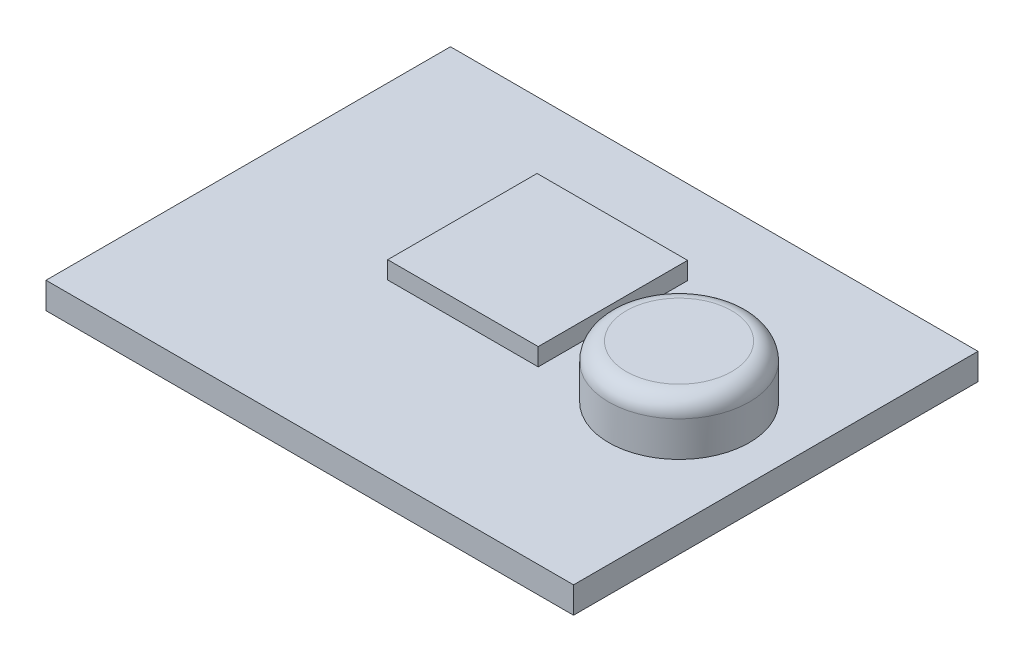
ISO-10303-21;
HEADER;
FILE_DESCRIPTION(('STEP AP214'),'2;1');
FILE_NAME('part.step','',(''),(''),'','','');
FILE_SCHEMA(('AUTOMOTIVE_DESIGN { 1 0 10303 214 1 1 1 1 }'));
ENDSEC;
DATA;
#1=APPLICATION_CONTEXT('core data for automotive mechanical design processes');
#2=APPLICATION_PROTOCOL_DEFINITION('international standard','automotive_design',2000,#1);
#3=PRODUCT_CONTEXT('',#1,'mechanical');
#4=PRODUCT('Part','Part','',(#3));
#5=PRODUCT_RELATED_PRODUCT_CATEGORY('part','',(#4));
#6=PRODUCT_DEFINITION_FORMATION('','',#4);
#7=PRODUCT_DEFINITION_CONTEXT('part definition',#1,'design');
#8=PRODUCT_DEFINITION('design','',#6,#7);
#9=PRODUCT_DEFINITION_SHAPE('','',#8);
#10=(LENGTH_UNIT() NAMED_UNIT(*) SI_UNIT(.MILLI.,.METRE.));
#11=(NAMED_UNIT(*) PLANE_ANGLE_UNIT() SI_UNIT($,.RADIAN.));
#12=(NAMED_UNIT(*) SI_UNIT($,.STERADIAN.) SOLID_ANGLE_UNIT());
#13=UNCERTAINTY_MEASURE_WITH_UNIT(LENGTH_MEASURE(1.E-05),#10,'distance_accuracy_value','');
#14=(GEOMETRIC_REPRESENTATION_CONTEXT(3) GLOBAL_UNCERTAINTY_ASSIGNED_CONTEXT((#13)) GLOBAL_UNIT_ASSIGNED_CONTEXT((#10,
#11,#12)) REPRESENTATION_CONTEXT('',''));
#15=CARTESIAN_POINT('',(0.,0.,0.));
#16=DIRECTION('',(0.,0.,1.));
#17=DIRECTION('',(1.,0.,0.));
#18=AXIS2_PLACEMENT_3D('',#15,#16,#17);
#19=CARTESIAN_POINT('',(0.,1.5,-23.));
#20=DIRECTION('',(0.,-1.,0.));
#21=DIRECTION('',(0.,0.,-1.));
#22=AXIS2_PLACEMENT_3D('',#19,#20,#21);
#23=PLANE('',#22);
#24=DIRECTION('',(0.,0.,1.));
#25=VECTOR('',#24,1.);
#26=CARTESIAN_POINT('',(9.70415944520077,1.5,-18.2225399910899));
#27=LINE('',#26,#25);
#28=CARTESIAN_POINT('',(9.70415944520077,1.5,-18.2225399910899));
#29=VERTEX_POINT('',#28);
#30=CARTESIAN_POINT('',(9.70415944520077,1.5,-9.72788810527725));
#31=VERTEX_POINT('',#30);
#32=EDGE_CURVE('E119',#29,#31,#27,.T.);
#33=ORIENTED_EDGE('',*,*,#32,.F.);
#34=DIRECTION('',(-1.,0.,0.));
#35=VECTOR('',#34,1.);
#36=CARTESIAN_POINT('',(9.70415944520077,1.5,-18.2225399910899));
#37=LINE('',#36,#35);
#38=CARTESIAN_POINT('',(18.262441682218,1.5,-18.2225399910899));
#39=VERTEX_POINT('',#38);
#40=EDGE_CURVE('E116',#39,#29,#37,.T.);
#41=ORIENTED_EDGE('',*,*,#40,.F.);
#42=DIRECTION('',(0.,0.,-1.));
#43=VECTOR('',#42,1.);
#44=CARTESIAN_POINT('',(18.262441682218,1.5,-18.2225399910899));
#45=LINE('',#44,#43);
#46=CARTESIAN_POINT('',(18.262441682218,1.5,-9.72788810527725));
#47=VERTEX_POINT('',#46);
#48=EDGE_CURVE('E54',#47,#39,#45,.T.);
#49=ORIENTED_EDGE('',*,*,#48,.F.);
#50=DIRECTION('',(1.,0.,0.));
#51=VECTOR('',#50,1.);
#52=CARTESIAN_POINT('',(9.70415944520077,1.5,-9.72788810527725));
#53=LINE('',#52,#51);
#54=EDGE_CURVE('E49',#31,#47,#53,.T.);
#55=ORIENTED_EDGE('',*,*,#54,.F.);
#56=EDGE_LOOP('',(#33,#41,#49,#55));
#57=FACE_BOUND('',#56,.T.);
#58=DIRECTION('',(0.,0.,1.));
#59=VECTOR('',#58,1.);
#60=CARTESIAN_POINT('',(0.,1.5,0.));
#61=LINE('',#60,#59);
#62=CARTESIAN_POINT('',(0.,1.5,-23.));
#63=VERTEX_POINT('',#62);
#64=CARTESIAN_POINT('',(0.,1.5,0.));
#65=VERTEX_POINT('',#64);
#66=EDGE_CURVE('E129',#63,#65,#61,.T.);
#67=ORIENTED_EDGE('',*,*,#66,.T.);
#68=DIRECTION('',(1.,0.,0.));
#69=VECTOR('',#68,1.);
#70=CARTESIAN_POINT('',(0.,1.5,0.));
#71=LINE('',#70,#69);
#72=CARTESIAN_POINT('',(30.,1.5,0.));
#73=VERTEX_POINT('',#72);
#74=EDGE_CURVE('E132',#65,#73,#71,.T.);
#75=ORIENTED_EDGE('',*,*,#74,.T.);
#76=DIRECTION('',(0.,0.,-1.));
#77=VECTOR('',#76,1.);
#78=CARTESIAN_POINT('',(30.,1.5,0.));
#79=LINE('',#78,#77);
#80=CARTESIAN_POINT('',(30.,1.5,-23.));
#81=VERTEX_POINT('',#80);
#82=EDGE_CURVE('E135',#73,#81,#79,.T.);
#83=ORIENTED_EDGE('',*,*,#82,.T.);
#84=DIRECTION('',(-1.,0.,0.));
#85=VECTOR('',#84,1.);
#86=CARTESIAN_POINT('',(0.,1.5,-23.));
#87=LINE('',#86,#85);
#88=EDGE_CURVE('E137',#81,#63,#87,.T.);
#89=ORIENTED_EDGE('',*,*,#88,.T.);
#90=EDGE_LOOP('',(#67,#75,#83,#89));
#91=FACE_BOUND('',#90,.T.);
#92=CARTESIAN_POINT('',(24.,1.5,-12.));
#93=DIRECTION('',(0.,-1.,0.));
#94=DIRECTION('',(0.,0.,-1.));
#95=AXIS2_PLACEMENT_3D('',#92,#93,#94);
#96=CIRCLE('',#95,4.);
#97=CARTESIAN_POINT('',(24.,1.5,-16.));
#98=VERTEX_POINT('',#97);
#99=EDGE_CURVE('E155',#98,#98,#96,.F.);
#100=ORIENTED_EDGE('',*,*,#99,.F.);
#101=EDGE_LOOP('',(#100));
#102=FACE_BOUND('',#101,.T.);
#103=ADVANCED_FACE('F34',(#57,#91,#102),#23,.F.);
#104=CARTESIAN_POINT('',(0.,1.5,0.));
#105=DIRECTION('',(1.,0.,0.));
#106=DIRECTION('',(0.,0.,-1.));
#107=AXIS2_PLACEMENT_3D('',#104,#105,#106);
#108=PLANE('',#107);
#109=DIRECTION('',(0.,0.,1.));
#110=VECTOR('',#109,1.);
#111=CARTESIAN_POINT('',(0.,0.,0.));
#112=LINE('',#111,#110);
#113=CARTESIAN_POINT('',(0.,0.,-23.));
#114=VERTEX_POINT('',#113);
#115=CARTESIAN_POINT('',(0.,0.,0.));
#116=VERTEX_POINT('',#115);
#117=EDGE_CURVE('E120',#114,#116,#112,.T.);
#118=ORIENTED_EDGE('',*,*,#117,.T.);
#119=DIRECTION('',(0.,-1.,0.));
#120=VECTOR('',#119,1.);
#121=CARTESIAN_POINT('',(0.,1.5,0.));
#122=LINE('',#121,#120);
#123=EDGE_CURVE('E152',#65,#116,#122,.T.);
#124=ORIENTED_EDGE('',*,*,#123,.F.);
#125=ORIENTED_EDGE('',*,*,#66,.F.);
#126=DIRECTION('',(0.,-1.,0.));
#127=VECTOR('',#126,1.);
#128=CARTESIAN_POINT('',(0.,1.5,-23.));
#129=LINE('',#128,#127);
#130=EDGE_CURVE('E138',#63,#114,#129,.T.);
#131=ORIENTED_EDGE('',*,*,#130,.T.);
#132=EDGE_LOOP('',(#118,#124,#125,#131));
#133=FACE_BOUND('',#132,.T.);
#134=ADVANCED_FACE('F171',(#133),#108,.F.);
#135=CARTESIAN_POINT('',(0.,1.5,0.));
#136=DIRECTION('',(0.,0.,-1.));
#137=DIRECTION('',(-1.,0.,0.));
#138=AXIS2_PLACEMENT_3D('',#135,#136,#137);
#139=PLANE('',#138);
#140=DIRECTION('',(1.,0.,0.));
#141=VECTOR('',#140,1.);
#142=CARTESIAN_POINT('',(0.,0.,0.));
#143=LINE('',#142,#141);
#144=CARTESIAN_POINT('',(30.,0.,0.));
#145=VERTEX_POINT('',#144);
#146=EDGE_CURVE('E123',#116,#145,#143,.T.);
#147=ORIENTED_EDGE('',*,*,#146,.T.);
#148=DIRECTION('',(0.,-1.,0.));
#149=VECTOR('',#148,1.);
#150=CARTESIAN_POINT('',(30.,1.5,0.));
#151=LINE('',#150,#149);
#152=EDGE_CURVE('E149',#73,#145,#151,.T.);
#153=ORIENTED_EDGE('',*,*,#152,.F.);
#154=ORIENTED_EDGE('',*,*,#74,.F.);
#155=ORIENTED_EDGE('',*,*,#123,.T.);
#156=EDGE_LOOP('',(#147,#153,#154,#155));
#157=FACE_BOUND('',#156,.T.);
#158=ADVANCED_FACE('F176',(#157),#139,.F.);
#159=CARTESIAN_POINT('',(30.,1.5,0.));
#160=DIRECTION('',(-1.,0.,0.));
#161=DIRECTION('',(0.,0.,1.));
#162=AXIS2_PLACEMENT_3D('',#159,#160,#161);
#163=PLANE('',#162);
#164=DIRECTION('',(0.,0.,-1.));
#165=VECTOR('',#164,1.);
#166=CARTESIAN_POINT('',(30.,0.,0.));
#167=LINE('',#166,#165);
#168=CARTESIAN_POINT('',(30.,0.,-23.));
#169=VERTEX_POINT('',#168);
#170=EDGE_CURVE('E141',#145,#169,#167,.T.);
#171=ORIENTED_EDGE('',*,*,#170,.T.);
#172=DIRECTION('',(0.,-1.,0.));
#173=VECTOR('',#172,1.);
#174=CARTESIAN_POINT('',(30.,1.5,-23.));
#175=LINE('',#174,#173);
#176=EDGE_CURVE('E146',#81,#169,#175,.T.);
#177=ORIENTED_EDGE('',*,*,#176,.F.);
#178=ORIENTED_EDGE('',*,*,#82,.F.);
#179=ORIENTED_EDGE('',*,*,#152,.T.);
#180=EDGE_LOOP('',(#171,#177,#178,#179));
#181=FACE_BOUND('',#180,.T.);
#182=ADVANCED_FACE('F189',(#181),#163,.F.);
#183=CARTESIAN_POINT('',(0.,1.5,-23.));
#184=DIRECTION('',(0.,0.,1.));
#185=DIRECTION('',(1.,0.,0.));
#186=AXIS2_PLACEMENT_3D('',#183,#184,#185);
#187=PLANE('',#186);
#188=DIRECTION('',(-1.,0.,0.));
#189=VECTOR('',#188,1.);
#190=CARTESIAN_POINT('',(0.,0.,-23.));
#191=LINE('',#190,#189);
#192=EDGE_CURVE('E133',#169,#114,#191,.T.);
#193=ORIENTED_EDGE('',*,*,#192,.T.);
#194=ORIENTED_EDGE('',*,*,#130,.F.);
#195=ORIENTED_EDGE('',*,*,#88,.F.);
#196=ORIENTED_EDGE('',*,*,#176,.T.);
#197=EDGE_LOOP('',(#193,#194,#195,#196));
#198=FACE_BOUND('',#197,.T.);
#199=ADVANCED_FACE('F185',(#198),#187,.F.);
#200=CARTESIAN_POINT('',(0.,0.,-23.));
#201=DIRECTION('',(0.,-1.,0.));
#202=DIRECTION('',(0.,0.,-1.));
#203=AXIS2_PLACEMENT_3D('',#200,#201,#202);
#204=PLANE('',#203);
#205=ORIENTED_EDGE('',*,*,#117,.F.);
#206=ORIENTED_EDGE('',*,*,#192,.F.);
#207=ORIENTED_EDGE('',*,*,#170,.F.);
#208=ORIENTED_EDGE('',*,*,#146,.F.);
#209=EDGE_LOOP('',(#205,#206,#207,#208));
#210=FACE_BOUND('',#209,.T.);
#211=ADVANCED_FACE('F182',(#210),#204,.T.);
#212=CARTESIAN_POINT('',(9.70415944520077,2.5,-18.2225399910899));
#213=DIRECTION('',(1.,0.,0.));
#214=DIRECTION('',(0.,0.,-1.));
#215=AXIS2_PLACEMENT_3D('',#212,#213,#214);
#216=PLANE('',#215);
#217=ORIENTED_EDGE('',*,*,#32,.T.);
#218=DIRECTION('',(0.,-1.,0.));
#219=VECTOR('',#218,1.);
#220=CARTESIAN_POINT('',(9.70415944520077,2.5,-9.72788810527725));
#221=LINE('',#220,#219);
#222=CARTESIAN_POINT('',(9.70415944520077,2.5,-9.72788810527725));
#223=VERTEX_POINT('',#222);
#224=EDGE_CURVE('E100',#223,#31,#221,.T.);
#225=ORIENTED_EDGE('',*,*,#224,.F.);
#226=DIRECTION('',(0.,0.,1.));
#227=VECTOR('',#226,1.);
#228=CARTESIAN_POINT('',(9.70415944520077,2.5,-18.2225399910899));
#229=LINE('',#228,#227);
#230=CARTESIAN_POINT('',(9.70415944520077,2.5,-18.2225399910899));
#231=VERTEX_POINT('',#230);
#232=EDGE_CURVE('E107',#231,#223,#229,.T.);
#233=ORIENTED_EDGE('',*,*,#232,.F.);
#234=DIRECTION('',(0.,-1.,0.));
#235=VECTOR('',#234,1.);
#236=CARTESIAN_POINT('',(9.70415944520077,2.5,-18.2225399910899));
#237=LINE('',#236,#235);
#238=EDGE_CURVE('E308',#231,#29,#237,.T.);
#239=ORIENTED_EDGE('',*,*,#238,.T.);
#240=EDGE_LOOP('',(#217,#225,#233,#239));
#241=FACE_BOUND('',#240,.T.);
#242=ADVANCED_FACE('F118',(#241),#216,.F.);
#243=CARTESIAN_POINT('',(9.70415944520077,2.5,-9.72788810527725));
#244=DIRECTION('',(0.,0.,-1.));
#245=DIRECTION('',(-1.,0.,0.));
#246=AXIS2_PLACEMENT_3D('',#243,#244,#245);
#247=PLANE('',#246);
#248=ORIENTED_EDGE('',*,*,#54,.T.);
#249=DIRECTION('',(0.,-1.,0.));
#250=VECTOR('',#249,1.);
#251=CARTESIAN_POINT('',(18.262441682218,2.5,-9.72788810527725));
#252=LINE('',#251,#250);
#253=CARTESIAN_POINT('',(18.262441682218,2.5,-9.72788810527725));
#254=VERTEX_POINT('',#253);
#255=EDGE_CURVE('E103',#254,#47,#252,.T.);
#256=ORIENTED_EDGE('',*,*,#255,.F.);
#257=DIRECTION('',(1.,0.,0.));
#258=VECTOR('',#257,1.);
#259=CARTESIAN_POINT('',(9.70415944520077,2.5,-9.72788810527725));
#260=LINE('',#259,#258);
#261=EDGE_CURVE('E96',#223,#254,#260,.T.);
#262=ORIENTED_EDGE('',*,*,#261,.F.);
#263=ORIENTED_EDGE('',*,*,#224,.T.);
#264=EDGE_LOOP('',(#248,#256,#262,#263));
#265=FACE_BOUND('',#264,.T.);
#266=ADVANCED_FACE('F98',(#265),#247,.F.);
#267=CARTESIAN_POINT('',(18.262441682218,2.5,-18.2225399910899));
#268=DIRECTION('',(-1.,0.,0.));
#269=DIRECTION('',(0.,0.,1.));
#270=AXIS2_PLACEMENT_3D('',#267,#268,#269);
#271=PLANE('',#270);
#272=ORIENTED_EDGE('',*,*,#48,.T.);
#273=DIRECTION('',(0.,-1.,0.));
#274=VECTOR('',#273,1.);
#275=CARTESIAN_POINT('',(18.262441682218,2.5,-18.2225399910899));
#276=LINE('',#275,#274);
#277=CARTESIAN_POINT('',(18.262441682218,2.5,-18.2225399910899));
#278=VERTEX_POINT('',#277);
#279=EDGE_CURVE('E125',#278,#39,#276,.T.);
#280=ORIENTED_EDGE('',*,*,#279,.F.);
#281=DIRECTION('',(0.,0.,-1.));
#282=VECTOR('',#281,1.);
#283=CARTESIAN_POINT('',(18.262441682218,2.5,-18.2225399910899));
#284=LINE('',#283,#282);
#285=EDGE_CURVE('E106',#254,#278,#284,.T.);
#286=ORIENTED_EDGE('',*,*,#285,.F.);
#287=ORIENTED_EDGE('',*,*,#255,.T.);
#288=EDGE_LOOP('',(#272,#280,#286,#287));
#289=FACE_BOUND('',#288,.T.);
#290=ADVANCED_FACE('F222',(#289),#271,.F.);
#291=CARTESIAN_POINT('',(9.70415944520077,2.5,-18.2225399910899));
#292=DIRECTION('',(0.,0.,1.));
#293=DIRECTION('',(1.,0.,0.));
#294=AXIS2_PLACEMENT_3D('',#291,#292,#293);
#295=PLANE('',#294);
#296=ORIENTED_EDGE('',*,*,#40,.T.);
#297=ORIENTED_EDGE('',*,*,#238,.F.);
#298=DIRECTION('',(-1.,0.,0.));
#299=VECTOR('',#298,1.);
#300=CARTESIAN_POINT('',(9.70415944520077,2.5,-18.2225399910899));
#301=LINE('',#300,#299);
#302=EDGE_CURVE('E112',#278,#231,#301,.T.);
#303=ORIENTED_EDGE('',*,*,#302,.F.);
#304=ORIENTED_EDGE('',*,*,#279,.T.);
#305=EDGE_LOOP('',(#296,#297,#303,#304));
#306=FACE_BOUND('',#305,.T.);
#307=ADVANCED_FACE('F217',(#306),#295,.F.);
#308=CARTESIAN_POINT('',(9.70415944520077,2.5,-9.72788810527725));
#309=DIRECTION('',(0.,1.,0.));
#310=DIRECTION('',(0.,0.,1.));
#311=AXIS2_PLACEMENT_3D('',#308,#309,#310);
#312=PLANE('',#311);
#313=ORIENTED_EDGE('',*,*,#232,.T.);
#314=ORIENTED_EDGE('',*,*,#261,.T.);
#315=ORIENTED_EDGE('',*,*,#285,.T.);
#316=ORIENTED_EDGE('',*,*,#302,.T.);
#317=EDGE_LOOP('',(#313,#314,#315,#316));
#318=FACE_BOUND('',#317,.T.);
#319=ADVANCED_FACE('F110',(#318),#312,.T.);
#320=CARTESIAN_POINT('',(24.,4.5,-12.));
#321=DIRECTION('',(0.,-1.,0.));
#322=DIRECTION('',(0.,0.,-1.));
#323=AXIS2_PLACEMENT_3D('',#320,#321,#322);
#324=CYLINDRICAL_SURFACE('',#323,4.);
#325=CARTESIAN_POINT('',(24.,3.5,-12.));
#326=DIRECTION('',(0.,1.,0.));
#327=DIRECTION('',(0.,0.,1.));
#328=AXIS2_PLACEMENT_3D('',#325,#326,#327);
#329=CIRCLE('',#328,4.);
#330=CARTESIAN_POINT('',(24.,3.5,-8.));
#331=VERTEX_POINT('',#330);
#332=EDGE_CURVE('E11',#331,#331,#329,.F.);
#333=ORIENTED_EDGE('',*,*,#332,.T.);
#334=EDGE_LOOP('',(#333));
#335=FACE_BOUND('',#334,.T.);
#336=ORIENTED_EDGE('',*,*,#99,.T.);
#337=EDGE_LOOP('',(#336));
#338=FACE_BOUND('',#337,.T.);
#339=ADVANCED_FACE('F167',(#335,#338),#324,.T.);
#340=CARTESIAN_POINT('',(24.,4.5,-12.));
#341=DIRECTION('',(0.,1.,0.));
#342=DIRECTION('',(0.,0.,1.));
#343=AXIS2_PLACEMENT_3D('',#340,#341,#342);
#344=PLANE('',#343);
#345=CARTESIAN_POINT('',(24.,4.5,-12.));
#346=DIRECTION('',(0.,1.,0.));
#347=DIRECTION('',(0.,0.,1.));
#348=AXIS2_PLACEMENT_3D('',#345,#346,#347);
#349=CIRCLE('',#348,3.);
#350=CARTESIAN_POINT('',(24.,4.5,-9.));
#351=VERTEX_POINT('',#350);
#352=EDGE_CURVE('E42',#351,#351,#349,.T.);
#353=ORIENTED_EDGE('',*,*,#352,.T.);
#354=EDGE_LOOP('',(#353));
#355=FACE_BOUND('',#354,.T.);
#356=ADVANCED_FACE('F160',(#355),#344,.T.);
#357=CARTESIAN_POINT('',(24.,3.5,-12.));
#358=DIRECTION('',(0.,1.,0.));
#359=DIRECTION('',(0.,0.,1.));
#360=AXIS2_PLACEMENT_3D('',#357,#358,#359);
#361=TOROIDAL_SURFACE('',#360,3.,1.);
#362=ORIENTED_EDGE('',*,*,#332,.F.);
#363=EDGE_LOOP('',(#362));
#364=FACE_BOUND('',#363,.T.);
#365=ORIENTED_EDGE('',*,*,#352,.F.);
#366=EDGE_LOOP('',(#365));
#367=FACE_BOUND('',#366,.T.);
#368=ADVANCED_FACE('F36',(#364,#367),#361,.T.);
#369=CLOSED_SHELL('',(#103,#134,#158,#182,#199,#211,#242,#266,#290,#307,#319,#339,#356,#368));
#370=MANIFOLD_SOLID_BREP('B2',#369);
#371=ADVANCED_BREP_SHAPE_REPRESENTATION('',(#18,#370),#14);
#372=SHAPE_DEFINITION_REPRESENTATION(#9,#371);
ENDSEC;
END-ISO-10303-21;
